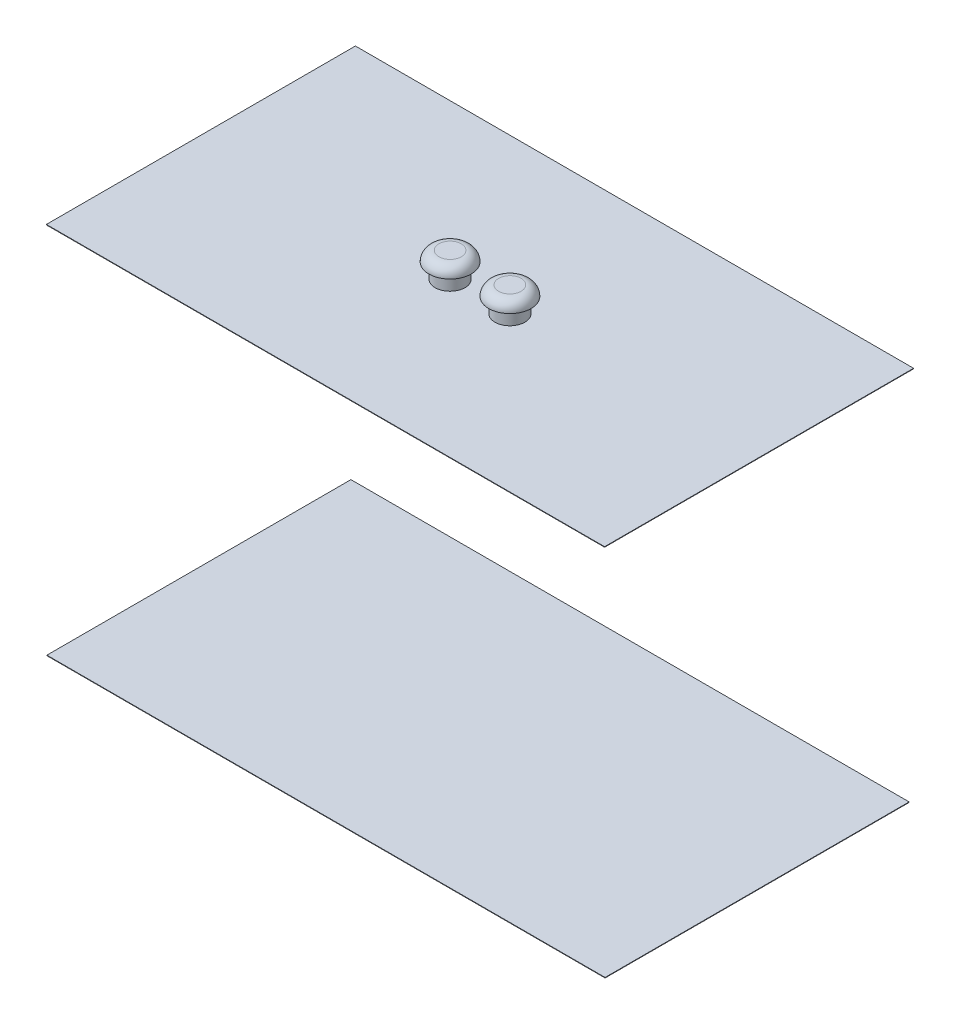
ISO-10303-21;
HEADER;
FILE_DESCRIPTION(('STEP AP214'),'2;1');
FILE_NAME('part.step','',(''),(''),'','','');
FILE_SCHEMA(('AUTOMOTIVE_DESIGN { 1 0 10303 214 1 1 1 1 }'));
ENDSEC;
DATA;
#1=APPLICATION_CONTEXT('core data for automotive mechanical design processes');
#2=APPLICATION_PROTOCOL_DEFINITION('international standard','automotive_design',2000,#1);
#3=PRODUCT_CONTEXT('',#1,'mechanical');
#4=PRODUCT('Part','Part','',(#3));
#5=PRODUCT_RELATED_PRODUCT_CATEGORY('part','',(#4));
#6=PRODUCT_DEFINITION_FORMATION('','',#4);
#7=PRODUCT_DEFINITION_CONTEXT('part definition',#1,'design');
#8=PRODUCT_DEFINITION('design','',#6,#7);
#9=PRODUCT_DEFINITION_SHAPE('','',#8);
#10=(LENGTH_UNIT() NAMED_UNIT(*) SI_UNIT(.MILLI.,.METRE.));
#11=(NAMED_UNIT(*) PLANE_ANGLE_UNIT() SI_UNIT($,.RADIAN.));
#12=(NAMED_UNIT(*) SI_UNIT($,.STERADIAN.) SOLID_ANGLE_UNIT());
#13=UNCERTAINTY_MEASURE_WITH_UNIT(LENGTH_MEASURE(1.E-05),#10,'distance_accuracy_value','');
#14=(GEOMETRIC_REPRESENTATION_CONTEXT(3) GLOBAL_UNCERTAINTY_ASSIGNED_CONTEXT((#13)) GLOBAL_UNIT_ASSIGNED_CONTEXT((#10,
#11,#12)) REPRESENTATION_CONTEXT('',''));
#15=CARTESIAN_POINT('',(0.,0.,0.));
#16=DIRECTION('',(0.,0.,1.));
#17=DIRECTION('',(1.,0.,0.));
#18=AXIS2_PLACEMENT_3D('',#15,#16,#17);
#19=CARTESIAN_POINT('',(0.,374.,0.));
#20=DIRECTION('',(0.,0.,1.));
#21=DIRECTION('',(1.,0.,0.));
#22=AXIS2_PLACEMENT_3D('',#19,#20,#21);
#23=PLANE('',#22);
#24=DIRECTION('',(1.,0.,0.));
#25=VECTOR('',#24,1.);
#26=CARTESIAN_POINT('',(0.,375.,0.));
#27=LINE('',#26,#25);
#28=CARTESIAN_POINT('',(-560.,375.,0.));
#29=VERTEX_POINT('',#28);
#30=CARTESIAN_POINT('',(560.,375.,0.));
#31=VERTEX_POINT('',#30);
#32=EDGE_CURVE('E118',#29,#31,#27,.T.);
#33=ORIENTED_EDGE('',*,*,#32,.F.);
#34=DIRECTION('',(0.,1.,0.));
#35=VECTOR('',#34,1.);
#36=CARTESIAN_POINT('',(-560.,374.,0.));
#37=LINE('',#36,#35);
#38=CARTESIAN_POINT('',(-560.,374.,0.));
#39=VERTEX_POINT('',#38);
#40=EDGE_CURVE('E70',#39,#29,#37,.T.);
#41=ORIENTED_EDGE('',*,*,#40,.F.);
#42=DIRECTION('',(1.,0.,0.));
#43=VECTOR('',#42,1.);
#44=CARTESIAN_POINT('',(0.,374.,0.));
#45=LINE('',#44,#43);
#46=CARTESIAN_POINT('',(560.,374.,0.));
#47=VERTEX_POINT('',#46);
#48=EDGE_CURVE('E136',#39,#47,#45,.T.);
#49=ORIENTED_EDGE('',*,*,#48,.T.);
#50=DIRECTION('',(0.,1.,0.));
#51=VECTOR('',#50,1.);
#52=CARTESIAN_POINT('',(560.,374.,0.));
#53=LINE('',#52,#51);
#54=EDGE_CURVE('E115',#47,#31,#53,.T.);
#55=ORIENTED_EDGE('',*,*,#54,.T.);
#56=EDGE_LOOP('',(#33,#41,#49,#55));
#57=FACE_BOUND('',#56,.T.);
#58=ADVANCED_FACE('F53',(#57),#23,.T.);
#59=CARTESIAN_POINT('',(-560.,374.,0.));
#60=DIRECTION('',(-1.,0.,0.));
#61=DIRECTION('',(0.,0.,1.));
#62=AXIS2_PLACEMENT_3D('',#59,#60,#61);
#63=PLANE('',#62);
#64=DIRECTION('',(0.,0.,1.));
#65=VECTOR('',#64,1.);
#66=CARTESIAN_POINT('',(-560.,375.,0.));
#67=LINE('',#66,#65);
#68=CARTESIAN_POINT('',(-560.,375.,-620.));
#69=VERTEX_POINT('',#68);
#70=EDGE_CURVE('E105',#69,#29,#67,.T.);
#71=ORIENTED_EDGE('',*,*,#70,.F.);
#72=DIRECTION('',(0.,1.,0.));
#73=VECTOR('',#72,1.);
#74=CARTESIAN_POINT('',(-560.,374.,-620.));
#75=LINE('',#74,#73);
#76=CARTESIAN_POINT('',(-560.,374.,-620.));
#77=VERTEX_POINT('',#76);
#78=EDGE_CURVE('E81',#77,#69,#75,.T.);
#79=ORIENTED_EDGE('',*,*,#78,.F.);
#80=DIRECTION('',(0.,0.,1.));
#81=VECTOR('',#80,1.);
#82=CARTESIAN_POINT('',(-560.,374.,0.));
#83=LINE('',#82,#81);
#84=EDGE_CURVE('E134',#77,#39,#83,.T.);
#85=ORIENTED_EDGE('',*,*,#84,.T.);
#86=ORIENTED_EDGE('',*,*,#40,.T.);
#87=EDGE_LOOP('',(#71,#79,#85,#86));
#88=FACE_BOUND('',#87,.T.);
#89=ADVANCED_FACE('F161',(#88),#63,.T.);
#90=CARTESIAN_POINT('',(0.,374.,-620.));
#91=DIRECTION('',(0.,0.,-1.));
#92=DIRECTION('',(-1.,0.,0.));
#93=AXIS2_PLACEMENT_3D('',#90,#91,#92);
#94=PLANE('',#93);
#95=DIRECTION('',(-1.,0.,0.));
#96=VECTOR('',#95,1.);
#97=CARTESIAN_POINT('',(0.,375.,-620.));
#98=LINE('',#97,#96);
#99=CARTESIAN_POINT('',(560.,375.,-620.));
#100=VERTEX_POINT('',#99);
#101=EDGE_CURVE('E97',#100,#69,#98,.T.);
#102=ORIENTED_EDGE('',*,*,#101,.F.);
#103=DIRECTION('',(0.,1.,0.));
#104=VECTOR('',#103,1.);
#105=CARTESIAN_POINT('',(560.,374.,-620.));
#106=LINE('',#105,#104);
#107=CARTESIAN_POINT('',(560.,374.,-620.));
#108=VERTEX_POINT('',#107);
#109=EDGE_CURVE('E100',#108,#100,#106,.T.);
#110=ORIENTED_EDGE('',*,*,#109,.F.);
#111=DIRECTION('',(-1.,0.,0.));
#112=VECTOR('',#111,1.);
#113=CARTESIAN_POINT('',(0.,374.,-620.));
#114=LINE('',#113,#112);
#115=EDGE_CURVE('E89',#108,#77,#114,.T.);
#116=ORIENTED_EDGE('',*,*,#115,.T.);
#117=ORIENTED_EDGE('',*,*,#78,.T.);
#118=EDGE_LOOP('',(#102,#110,#116,#117));
#119=FACE_BOUND('',#118,.T.);
#120=ADVANCED_FACE('F99',(#119),#94,.T.);
#121=CARTESIAN_POINT('',(0.,374.,0.));
#122=DIRECTION('',(0.,1.,0.));
#123=DIRECTION('',(0.,0.,1.));
#124=AXIS2_PLACEMENT_3D('',#121,#122,#123);
#125=PLANE('',#124);
#126=ORIENTED_EDGE('',*,*,#115,.F.);
#127=DIRECTION('',(0.,0.,-1.));
#128=VECTOR('',#127,1.);
#129=CARTESIAN_POINT('',(560.,374.,0.));
#130=LINE('',#129,#128);
#131=EDGE_CURVE('E113',#47,#108,#130,.T.);
#132=ORIENTED_EDGE('',*,*,#131,.F.);
#133=ORIENTED_EDGE('',*,*,#48,.F.);
#134=ORIENTED_EDGE('',*,*,#84,.F.);
#135=EDGE_LOOP('',(#126,#132,#133,#134));
#136=FACE_BOUND('',#135,.T.);
#137=ADVANCED_FACE('F171',(#136),#125,.F.);
#138=CARTESIAN_POINT('',(0.,375.,0.));
#139=DIRECTION('',(0.,1.,0.));
#140=DIRECTION('',(0.,0.,1.));
#141=AXIS2_PLACEMENT_3D('',#138,#139,#140);
#142=PLANE('',#141);
#143=CARTESIAN_POINT('',(60.,375.,-310.));
#144=DIRECTION('',(0.,1.,0.));
#145=DIRECTION('',(0.,0.,1.));
#146=AXIS2_PLACEMENT_3D('',#143,#144,#145);
#147=CIRCLE('',#146,30.);
#148=CARTESIAN_POINT('',(60.,375.,-280.));
#149=VERTEX_POINT('',#148);
#150=EDGE_CURVE('E120',#149,#149,#147,.T.);
#151=ORIENTED_EDGE('',*,*,#150,.F.);
#152=EDGE_LOOP('',(#151));
#153=FACE_BOUND('',#152,.T.);
#154=CARTESIAN_POINT('',(-60.,375.,-310.));
#155=DIRECTION('',(0.,1.,0.));
#156=DIRECTION('',(0.,0.,1.));
#157=AXIS2_PLACEMENT_3D('',#154,#155,#156);
#158=CIRCLE('',#157,30.);
#159=CARTESIAN_POINT('',(-60.,375.,-280.));
#160=VERTEX_POINT('',#159);
#161=EDGE_CURVE('E114',#160,#160,#158,.T.);
#162=ORIENTED_EDGE('',*,*,#161,.F.);
#163=EDGE_LOOP('',(#162));
#164=FACE_BOUND('',#163,.T.);
#165=ORIENTED_EDGE('',*,*,#32,.T.);
#166=DIRECTION('',(0.,0.,-1.));
#167=VECTOR('',#166,1.);
#168=CARTESIAN_POINT('',(560.,375.,0.));
#169=LINE('',#168,#167);
#170=EDGE_CURVE('E112',#31,#100,#169,.T.);
#171=ORIENTED_EDGE('',*,*,#170,.T.);
#172=ORIENTED_EDGE('',*,*,#101,.T.);
#173=ORIENTED_EDGE('',*,*,#70,.T.);
#174=EDGE_LOOP('',(#165,#171,#172,#173));
#175=FACE_BOUND('',#174,.T.);
#176=ADVANCED_FACE('F117',(#153,#164,#175),#142,.T.);
#177=CARTESIAN_POINT('',(-60.,405.,-310.));
#178=DIRECTION('',(0.,-1.,0.));
#179=DIRECTION('',(0.,0.,-1.));
#180=AXIS2_PLACEMENT_3D('',#177,#178,#179);
#181=CYLINDRICAL_SURFACE('',#180,30.);
#182=CARTESIAN_POINT('',(-60.,405.,-310.));
#183=DIRECTION('',(0.,1.,0.));
#184=DIRECTION('',(0.,0.,1.));
#185=AXIS2_PLACEMENT_3D('',#182,#183,#184);
#186=CIRCLE('',#185,30.);
#187=CARTESIAN_POINT('',(-60.,405.,-280.));
#188=VERTEX_POINT('',#187);
#189=EDGE_CURVE('E106',#188,#188,#186,.T.);
#190=ORIENTED_EDGE('',*,*,#189,.F.);
#191=EDGE_LOOP('',(#190));
#192=FACE_BOUND('',#191,.T.);
#193=ORIENTED_EDGE('',*,*,#161,.T.);
#194=EDGE_LOOP('',(#193));
#195=FACE_BOUND('',#194,.T.);
#196=ADVANCED_FACE('F178',(#192,#195),#181,.T.);
#197=CARTESIAN_POINT('',(560.,374.,0.));
#198=DIRECTION('',(1.,0.,0.));
#199=DIRECTION('',(0.,0.,-1.));
#200=AXIS2_PLACEMENT_3D('',#197,#198,#199);
#201=PLANE('',#200);
#202=ORIENTED_EDGE('',*,*,#170,.F.);
#203=ORIENTED_EDGE('',*,*,#54,.F.);
#204=ORIENTED_EDGE('',*,*,#131,.T.);
#205=ORIENTED_EDGE('',*,*,#109,.T.);
#206=EDGE_LOOP('',(#202,#203,#204,#205));
#207=FACE_BOUND('',#206,.T.);
#208=ADVANCED_FACE('F110',(#207),#201,.T.);
#209=CARTESIAN_POINT('',(60.,405.,-310.));
#210=DIRECTION('',(0.,-1.,0.));
#211=DIRECTION('',(0.,0.,-1.));
#212=AXIS2_PLACEMENT_3D('',#209,#210,#211);
#213=CYLINDRICAL_SURFACE('',#212,30.);
#214=CARTESIAN_POINT('',(60.,405.,-310.));
#215=DIRECTION('',(0.,1.,0.));
#216=DIRECTION('',(0.,0.,1.));
#217=AXIS2_PLACEMENT_3D('',#214,#215,#216);
#218=CIRCLE('',#217,30.);
#219=CARTESIAN_POINT('',(60.,405.,-280.));
#220=VERTEX_POINT('',#219);
#221=EDGE_CURVE('E124',#220,#220,#218,.T.);
#222=ORIENTED_EDGE('',*,*,#221,.F.);
#223=EDGE_LOOP('',(#222));
#224=FACE_BOUND('',#223,.T.);
#225=ORIENTED_EDGE('',*,*,#150,.T.);
#226=EDGE_LOOP('',(#225));
#227=FACE_BOUND('',#226,.T.);
#228=ADVANCED_FACE('F186',(#224,#227),#213,.T.);
#229=CARTESIAN_POINT('',(-60.,425.,-310.));
#230=DIRECTION('',(0.,1.,0.));
#231=DIRECTION('',(0.,0.,1.));
#232=AXIS2_PLACEMENT_3D('',#229,#230,#231);
#233=PLANE('',#232);
#234=CARTESIAN_POINT('',(-60.,425.,-310.));
#235=DIRECTION('',(0.,1.,0.));
#236=DIRECTION('',(0.,0.,1.));
#237=AXIS2_PLACEMENT_3D('',#234,#235,#236);
#238=CIRCLE('',#237,22.5);
#239=CARTESIAN_POINT('',(-60.,425.,-287.5));
#240=VERTEX_POINT('',#239);
#241=EDGE_CURVE('E62',#240,#240,#238,.T.);
#242=ORIENTED_EDGE('',*,*,#241,.T.);
#243=EDGE_LOOP('',(#242));
#244=FACE_BOUND('',#243,.T.);
#245=ADVANCED_FACE('F144',(#244),#233,.T.);
#246=CARTESIAN_POINT('',(-60.,405.,-310.));
#247=DIRECTION('',(0.,1.,0.));
#248=DIRECTION('',(0.,0.,1.));
#249=AXIS2_PLACEMENT_3D('',#246,#247,#248);
#250=PLANE('',#249);
#251=ORIENTED_EDGE('',*,*,#189,.T.);
#252=EDGE_LOOP('',(#251));
#253=FACE_BOUND('',#252,.T.);
#254=CARTESIAN_POINT('',(-60.,405.,-310.));
#255=DIRECTION('',(0.,1.,0.));
#256=DIRECTION('',(0.,0.,1.));
#257=AXIS2_PLACEMENT_3D('',#254,#255,#256);
#258=CIRCLE('',#257,42.5);
#259=CARTESIAN_POINT('',(-60.,405.,-267.5));
#260=VERTEX_POINT('',#259);
#261=EDGE_CURVE('E333',#260,#260,#258,.T.);
#262=ORIENTED_EDGE('',*,*,#261,.F.);
#263=EDGE_LOOP('',(#262));
#264=FACE_BOUND('',#263,.T.);
#265=ADVANCED_FACE('F190',(#253,#264),#250,.F.);
#266=CARTESIAN_POINT('',(60.,425.,-310.));
#267=DIRECTION('',(0.,1.,0.));
#268=DIRECTION('',(0.,0.,1.));
#269=AXIS2_PLACEMENT_3D('',#266,#267,#268);
#270=PLANE('',#269);
#271=CARTESIAN_POINT('',(60.,425.,-310.));
#272=DIRECTION('',(0.,1.,0.));
#273=DIRECTION('',(0.,0.,1.));
#274=AXIS2_PLACEMENT_3D('',#271,#272,#273);
#275=CIRCLE('',#274,22.5);
#276=CARTESIAN_POINT('',(60.,425.,-287.5));
#277=VERTEX_POINT('',#276);
#278=EDGE_CURVE('E12',#277,#277,#275,.T.);
#279=ORIENTED_EDGE('',*,*,#278,.T.);
#280=EDGE_LOOP('',(#279));
#281=FACE_BOUND('',#280,.T.);
#282=ADVANCED_FACE('F155',(#281),#270,.T.);
#283=CARTESIAN_POINT('',(60.,405.,-310.));
#284=DIRECTION('',(0.,1.,0.));
#285=DIRECTION('',(0.,0.,1.));
#286=AXIS2_PLACEMENT_3D('',#283,#284,#285);
#287=PLANE('',#286);
#288=ORIENTED_EDGE('',*,*,#221,.T.);
#289=EDGE_LOOP('',(#288));
#290=FACE_BOUND('',#289,.T.);
#291=CARTESIAN_POINT('',(60.,405.,-310.));
#292=DIRECTION('',(0.,1.,0.));
#293=DIRECTION('',(0.,0.,1.));
#294=AXIS2_PLACEMENT_3D('',#291,#292,#293);
#295=CIRCLE('',#294,42.5);
#296=CARTESIAN_POINT('',(60.,405.,-267.5));
#297=VERTEX_POINT('',#296);
#298=EDGE_CURVE('E334',#297,#297,#295,.T.);
#299=ORIENTED_EDGE('',*,*,#298,.F.);
#300=EDGE_LOOP('',(#299));
#301=FACE_BOUND('',#300,.T.);
#302=ADVANCED_FACE('F148',(#290,#301),#287,.F.);
#303=CARTESIAN_POINT('',(-60.,405.,-310.));
#304=DIRECTION('',(0.,1.,0.));
#305=DIRECTION('',(0.,0.,1.));
#306=AXIS2_PLACEMENT_3D('',#303,#304,#305);
#307=TOROIDAL_SURFACE('',#306,22.5,20.);
#308=ORIENTED_EDGE('',*,*,#261,.T.);
#309=EDGE_LOOP('',(#308));
#310=FACE_BOUND('',#309,.T.);
#311=ORIENTED_EDGE('',*,*,#241,.F.);
#312=EDGE_LOOP('',(#311));
#313=FACE_BOUND('',#312,.T.);
#314=ADVANCED_FACE('F146',(#310,#313),#307,.T.);
#315=CARTESIAN_POINT('',(60.,405.,-310.));
#316=DIRECTION('',(0.,1.,0.));
#317=DIRECTION('',(0.,0.,1.));
#318=AXIS2_PLACEMENT_3D('',#315,#316,#317);
#319=TOROIDAL_SURFACE('',#318,22.5,20.);
#320=ORIENTED_EDGE('',*,*,#298,.T.);
#321=EDGE_LOOP('',(#320));
#322=FACE_BOUND('',#321,.T.);
#323=ORIENTED_EDGE('',*,*,#278,.F.);
#324=EDGE_LOOP('',(#323));
#325=FACE_BOUND('',#324,.T.);
#326=ADVANCED_FACE('F55',(#322,#325),#319,.T.);
#327=CLOSED_SHELL('',(#58,#89,#120,#137,#176,#196,#208,#228,#245,#265,#282,#302,#314,#326));
#328=MANIFOLD_SOLID_BREP('B2',#327);
#329=CARTESIAN_POINT('',(-560.,-374.,-0.99999999999989));
#330=DIRECTION('',(-1.,0.,0.));
#331=DIRECTION('',(0.,0.,1.));
#332=AXIS2_PLACEMENT_3D('',#329,#330,#331);
#333=PLANE('',#332);
#334=DIRECTION('',(0.,0.,-1.));
#335=VECTOR('',#334,1.);
#336=CARTESIAN_POINT('',(-560.,-375.,-0.99999999999989));
#337=LINE('',#336,#335);
#338=CARTESIAN_POINT('',(-560.,-375.,-0.99999999999989));
#339=VERTEX_POINT('',#338);
#340=CARTESIAN_POINT('',(-560.,-375.,-611.000000000004));
#341=VERTEX_POINT('',#340);
#342=EDGE_CURVE('E415',#339,#341,#337,.T.);
#343=ORIENTED_EDGE('',*,*,#342,.F.);
#344=DIRECTION('',(0.,-1.,0.));
#345=VECTOR('',#344,1.);
#346=CARTESIAN_POINT('',(-560.,-374.,-0.99999999999989));
#347=LINE('',#346,#345);
#348=CARTESIAN_POINT('',(-560.,-374.,-0.99999999999989));
#349=VERTEX_POINT('',#348);
#350=EDGE_CURVE('E51',#349,#339,#347,.T.);
#351=ORIENTED_EDGE('',*,*,#350,.F.);
#352=DIRECTION('',(0.,0.,-1.));
#353=VECTOR('',#352,1.);
#354=CARTESIAN_POINT('',(-560.,-374.,-0.99999999999989));
#355=LINE('',#354,#353);
#356=CARTESIAN_POINT('',(-560.,-374.,-611.000000000004));
#357=VERTEX_POINT('',#356);
#358=EDGE_CURVE('E409',#349,#357,#355,.T.);
#359=ORIENTED_EDGE('',*,*,#358,.T.);
#360=DIRECTION('',(0.,-1.,0.));
#361=VECTOR('',#360,1.);
#362=CARTESIAN_POINT('',(-560.,-374.,-611.000000000004));
#363=LINE('',#362,#361);
#364=EDGE_CURVE('E354',#357,#341,#363,.T.);
#365=ORIENTED_EDGE('',*,*,#364,.T.);
#366=EDGE_LOOP('',(#343,#351,#359,#365));
#367=FACE_BOUND('',#366,.T.);
#368=ADVANCED_FACE('F351',(#367),#333,.T.);
#369=CARTESIAN_POINT('',(-560.,-374.,-0.99999999999989));
#370=DIRECTION('',(0.,0.,1.));
#371=DIRECTION('',(1.,0.,0.));
#372=AXIS2_PLACEMENT_3D('',#369,#370,#371);
#373=PLANE('',#372);
#374=DIRECTION('',(-1.,0.,0.));
#375=VECTOR('',#374,1.);
#376=CARTESIAN_POINT('',(-560.,-375.,-0.99999999999989));
#377=LINE('',#376,#375);
#378=CARTESIAN_POINT('',(560.,-375.,-0.99999999999989));
#379=VERTEX_POINT('',#378);
#380=EDGE_CURVE('E411',#379,#339,#377,.T.);
#381=ORIENTED_EDGE('',*,*,#380,.F.);
#382=DIRECTION('',(0.,-1.,0.));
#383=VECTOR('',#382,1.);
#384=CARTESIAN_POINT('',(560.,-374.,-0.99999999999989));
#385=LINE('',#384,#383);
#386=CARTESIAN_POINT('',(560.,-374.,-0.99999999999989));
#387=VERTEX_POINT('',#386);
#388=EDGE_CURVE('E360',#387,#379,#385,.T.);
#389=ORIENTED_EDGE('',*,*,#388,.F.);
#390=DIRECTION('',(-1.,0.,0.));
#391=VECTOR('',#390,1.);
#392=CARTESIAN_POINT('',(-560.,-374.,-0.99999999999989));
#393=LINE('',#392,#391);
#394=EDGE_CURVE('E406',#387,#349,#393,.T.);
#395=ORIENTED_EDGE('',*,*,#394,.T.);
#396=ORIENTED_EDGE('',*,*,#350,.T.);
#397=EDGE_LOOP('',(#381,#389,#395,#396));
#398=FACE_BOUND('',#397,.T.);
#399=ADVANCED_FACE('F425',(#398),#373,.T.);
#400=CARTESIAN_POINT('',(560.,-374.,-0.99999999999989));
#401=DIRECTION('',(1.,0.,0.));
#402=DIRECTION('',(0.,0.,-1.));
#403=AXIS2_PLACEMENT_3D('',#400,#401,#402);
#404=PLANE('',#403);
#405=DIRECTION('',(0.,0.,1.));
#406=VECTOR('',#405,1.);
#407=CARTESIAN_POINT('',(560.,-375.,-0.99999999999989));
#408=LINE('',#407,#406);
#409=CARTESIAN_POINT('',(560.,-375.,-611.000000000004));
#410=VERTEX_POINT('',#409);
#411=EDGE_CURVE('E401',#410,#379,#408,.T.);
#412=ORIENTED_EDGE('',*,*,#411,.F.);
#413=DIRECTION('',(0.,-1.,0.));
#414=VECTOR('',#413,1.);
#415=CARTESIAN_POINT('',(560.,-374.,-611.000000000004));
#416=LINE('',#415,#414);
#417=CARTESIAN_POINT('',(560.,-374.,-611.000000000004));
#418=VERTEX_POINT('',#417);
#419=EDGE_CURVE('E396',#418,#410,#416,.T.);
#420=ORIENTED_EDGE('',*,*,#419,.F.);
#421=DIRECTION('',(0.,0.,1.));
#422=VECTOR('',#421,1.);
#423=CARTESIAN_POINT('',(560.,-374.,-0.99999999999989));
#424=LINE('',#423,#422);
#425=EDGE_CURVE('E399',#418,#387,#424,.T.);
#426=ORIENTED_EDGE('',*,*,#425,.T.);
#427=ORIENTED_EDGE('',*,*,#388,.T.);
#428=EDGE_LOOP('',(#412,#420,#426,#427));
#429=FACE_BOUND('',#428,.T.);
#430=ADVANCED_FACE('F398',(#429),#404,.T.);
#431=CARTESIAN_POINT('',(-560.,-374.,-611.000000000004));
#432=DIRECTION('',(0.,0.,-1.));
#433=DIRECTION('',(-1.,0.,0.));
#434=AXIS2_PLACEMENT_3D('',#431,#432,#433);
#435=PLANE('',#434);
#436=DIRECTION('',(1.,0.,0.));
#437=VECTOR('',#436,1.);
#438=CARTESIAN_POINT('',(-560.,-375.,-611.000000000004));
#439=LINE('',#438,#437);
#440=EDGE_CURVE('E418',#341,#410,#439,.T.);
#441=ORIENTED_EDGE('',*,*,#440,.F.);
#442=ORIENTED_EDGE('',*,*,#364,.F.);
#443=DIRECTION('',(1.,0.,0.));
#444=VECTOR('',#443,1.);
#445=CARTESIAN_POINT('',(-560.,-374.,-611.000000000004));
#446=LINE('',#445,#444);
#447=EDGE_CURVE('E405',#357,#418,#446,.T.);
#448=ORIENTED_EDGE('',*,*,#447,.T.);
#449=ORIENTED_EDGE('',*,*,#419,.T.);
#450=EDGE_LOOP('',(#441,#442,#448,#449));
#451=FACE_BOUND('',#450,.T.);
#452=ADVANCED_FACE('F408',(#451),#435,.T.);
#453=CARTESIAN_POINT('',(0.,-374.,0.));
#454=DIRECTION('',(0.,-1.,0.));
#455=DIRECTION('',(0.,0.,-1.));
#456=AXIS2_PLACEMENT_3D('',#453,#454,#455);
#457=PLANE('',#456);
#458=ORIENTED_EDGE('',*,*,#358,.F.);
#459=ORIENTED_EDGE('',*,*,#394,.F.);
#460=ORIENTED_EDGE('',*,*,#425,.F.);
#461=ORIENTED_EDGE('',*,*,#447,.F.);
#462=EDGE_LOOP('',(#458,#459,#460,#461));
#463=FACE_BOUND('',#462,.T.);
#464=ADVANCED_FACE('F404',(#463),#457,.F.);
#465=CARTESIAN_POINT('',(0.,-375.,0.));
#466=DIRECTION('',(0.,-1.,0.));
#467=DIRECTION('',(0.,0.,-1.));
#468=AXIS2_PLACEMENT_3D('',#465,#466,#467);
#469=PLANE('',#468);
#470=ORIENTED_EDGE('',*,*,#342,.T.);
#471=ORIENTED_EDGE('',*,*,#440,.T.);
#472=ORIENTED_EDGE('',*,*,#411,.T.);
#473=ORIENTED_EDGE('',*,*,#380,.T.);
#474=EDGE_LOOP('',(#470,#471,#472,#473));
#475=FACE_BOUND('',#474,.T.);
#476=ADVANCED_FACE('F424',(#475),#469,.T.);
#477=CLOSED_SHELL('',(#368,#399,#430,#452,#464,#476));
#478=MANIFOLD_SOLID_BREP('B6',#477);
#479=ADVANCED_BREP_SHAPE_REPRESENTATION('',(#18,#328,#478),#14);
#480=SHAPE_DEFINITION_REPRESENTATION(#9,#479);
ENDSEC;
END-ISO-10303-21;
